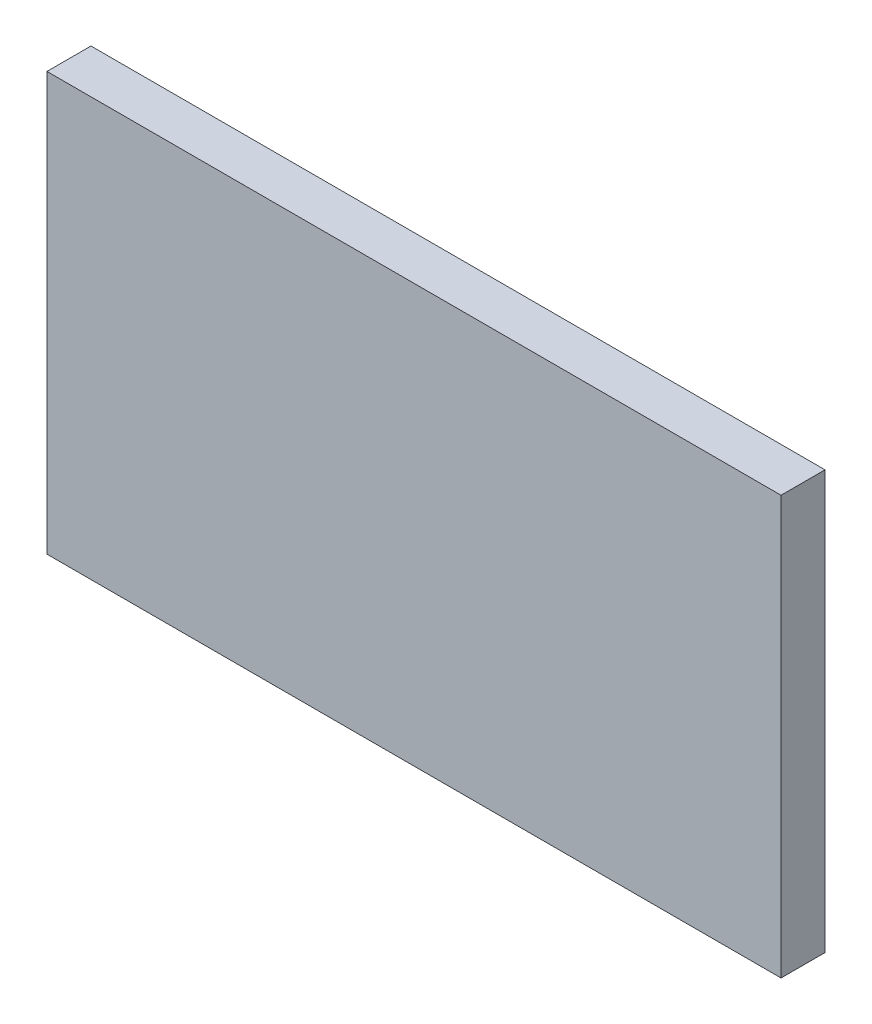
ISO-10303-21;
HEADER;
FILE_DESCRIPTION(('STEP AP214'),'2;1');
FILE_NAME('part.step','',(''),(''),'','','');
FILE_SCHEMA(('AUTOMOTIVE_DESIGN { 1 0 10303 214 1 1 1 1 }'));
ENDSEC;
DATA;
#1=APPLICATION_CONTEXT('core data for automotive mechanical design processes');
#2=APPLICATION_PROTOCOL_DEFINITION('international standard','automotive_design',2000,#1);
#3=PRODUCT_CONTEXT('',#1,'mechanical');
#4=PRODUCT('Part','Part','',(#3));
#5=PRODUCT_RELATED_PRODUCT_CATEGORY('part','',(#4));
#6=PRODUCT_DEFINITION_FORMATION('','',#4);
#7=PRODUCT_DEFINITION_CONTEXT('part definition',#1,'design');
#8=PRODUCT_DEFINITION('design','',#6,#7);
#9=PRODUCT_DEFINITION_SHAPE('','',#8);
#10=(LENGTH_UNIT() NAMED_UNIT(*) SI_UNIT(.MILLI.,.METRE.));
#11=(NAMED_UNIT(*) PLANE_ANGLE_UNIT() SI_UNIT($,.RADIAN.));
#12=(NAMED_UNIT(*) SI_UNIT($,.STERADIAN.) SOLID_ANGLE_UNIT());
#13=UNCERTAINTY_MEASURE_WITH_UNIT(LENGTH_MEASURE(1.E-05),#10,'distance_accuracy_value','');
#14=(GEOMETRIC_REPRESENTATION_CONTEXT(3) GLOBAL_UNCERTAINTY_ASSIGNED_CONTEXT((#13)) GLOBAL_UNIT_ASSIGNED_CONTEXT((#10,
#11,#12)) REPRESENTATION_CONTEXT('',''));
#15=CARTESIAN_POINT('',(0.,0.,0.));
#16=DIRECTION('',(0.,0.,1.));
#17=DIRECTION('',(1.,0.,0.));
#18=AXIS2_PLACEMENT_3D('',#15,#16,#17);
#19=CARTESIAN_POINT('',(-0.838,-0.47,0.1));
#20=DIRECTION('',(0.,0.,-1.));
#21=DIRECTION('',(-1.,0.,0.));
#22=AXIS2_PLACEMENT_3D('',#19,#20,#21);
#23=PLANE('',#22);
#24=DIRECTION('',(0.,1.,0.));
#25=VECTOR('',#24,1.);
#26=CARTESIAN_POINT('',(0.83,-0.47,0.1));
#27=LINE('',#26,#25);
#28=CARTESIAN_POINT('',(0.83,-0.47,0.1));
#29=VERTEX_POINT('',#28);
#30=CARTESIAN_POINT('',(0.83,0.48,0.1));
#31=VERTEX_POINT('',#30);
#32=EDGE_CURVE('E55',#29,#31,#27,.T.);
#33=ORIENTED_EDGE('',*,*,#32,.T.);
#34=DIRECTION('',(1.,0.,0.));
#35=VECTOR('',#34,1.);
#36=CARTESIAN_POINT('',(0.83,0.48,0.1));
#37=LINE('',#36,#35);
#38=CARTESIAN_POINT('',(-0.838,0.48,0.1));
#39=VERTEX_POINT('',#38);
#40=EDGE_CURVE('E57',#31,#39,#37,.F.);
#41=ORIENTED_EDGE('',*,*,#40,.T.);
#42=DIRECTION('',(0.,1.,0.));
#43=VECTOR('',#42,1.);
#44=CARTESIAN_POINT('',(-0.838,0.48,0.1));
#45=LINE('',#44,#43);
#46=CARTESIAN_POINT('',(-0.838,-0.47,0.1));
#47=VERTEX_POINT('',#46);
#48=EDGE_CURVE('E20',#39,#47,#45,.F.);
#49=ORIENTED_EDGE('',*,*,#48,.T.);
#50=DIRECTION('',(1.,0.,0.));
#51=VECTOR('',#50,1.);
#52=CARTESIAN_POINT('',(-0.838,-0.47,0.1));
#53=LINE('',#52,#51);
#54=EDGE_CURVE('E80',#47,#29,#53,.T.);
#55=ORIENTED_EDGE('',*,*,#54,.T.);
#56=EDGE_LOOP('',(#33,#41,#49,#55));
#57=FACE_BOUND('',#56,.T.);
#58=ADVANCED_FACE('F17',(#57),#23,.F.);
#59=CARTESIAN_POINT('',(-0.838,0.48,0.));
#60=DIRECTION('',(1.,0.,0.));
#61=DIRECTION('',(0.,0.,-1.));
#62=AXIS2_PLACEMENT_3D('',#59,#60,#61);
#63=PLANE('',#62);
#64=DIRECTION('',(0.,0.,1.));
#65=VECTOR('',#64,1.);
#66=CARTESIAN_POINT('',(-0.838,-0.47,0.));
#67=LINE('',#66,#65);
#68=CARTESIAN_POINT('',(-0.838,-0.47,0.));
#69=VERTEX_POINT('',#68);
#70=EDGE_CURVE('E68',#69,#47,#67,.T.);
#71=ORIENTED_EDGE('',*,*,#70,.T.);
#72=ORIENTED_EDGE('',*,*,#48,.F.);
#73=DIRECTION('',(0.,0.,-1.));
#74=VECTOR('',#73,1.);
#75=CARTESIAN_POINT('',(-0.838,0.48,0.));
#76=LINE('',#75,#74);
#77=CARTESIAN_POINT('',(-0.838,0.48,0.));
#78=VERTEX_POINT('',#77);
#79=EDGE_CURVE('E63',#39,#78,#76,.T.);
#80=ORIENTED_EDGE('',*,*,#79,.T.);
#81=DIRECTION('',(0.,1.,0.));
#82=VECTOR('',#81,1.);
#83=CARTESIAN_POINT('',(-0.838,-0.47,0.));
#84=LINE('',#83,#82);
#85=EDGE_CURVE('E83',#69,#78,#84,.T.);
#86=ORIENTED_EDGE('',*,*,#85,.F.);
#87=EDGE_LOOP('',(#71,#72,#80,#86));
#88=FACE_BOUND('',#87,.T.);
#89=ADVANCED_FACE('F65',(#88),#63,.F.);
#90=CARTESIAN_POINT('',(0.83,0.48,0.));
#91=DIRECTION('',(0.,-1.,0.));
#92=DIRECTION('',(0.,0.,-1.));
#93=AXIS2_PLACEMENT_3D('',#90,#91,#92);
#94=PLANE('',#93);
#95=ORIENTED_EDGE('',*,*,#79,.F.);
#96=ORIENTED_EDGE('',*,*,#40,.F.);
#97=DIRECTION('',(0.,0.,1.));
#98=VECTOR('',#97,1.);
#99=CARTESIAN_POINT('',(0.83,0.48,0.));
#100=LINE('',#99,#98);
#101=CARTESIAN_POINT('',(0.83,0.48,0.));
#102=VERTEX_POINT('',#101);
#103=EDGE_CURVE('E75',#31,#102,#100,.F.);
#104=ORIENTED_EDGE('',*,*,#103,.T.);
#105=DIRECTION('',(-1.,0.,0.));
#106=VECTOR('',#105,1.);
#107=CARTESIAN_POINT('',(-0.838,0.48,0.));
#108=LINE('',#107,#106);
#109=EDGE_CURVE('E72',#78,#102,#108,.F.);
#110=ORIENTED_EDGE('',*,*,#109,.F.);
#111=EDGE_LOOP('',(#95,#96,#104,#110));
#112=FACE_BOUND('',#111,.T.);
#113=ADVANCED_FACE('F70',(#112),#94,.F.);
#114=CARTESIAN_POINT('',(0.83,-0.47,0.));
#115=DIRECTION('',(-1.,0.,0.));
#116=DIRECTION('',(0.,0.,1.));
#117=AXIS2_PLACEMENT_3D('',#114,#115,#116);
#118=PLANE('',#117);
#119=ORIENTED_EDGE('',*,*,#103,.F.);
#120=ORIENTED_EDGE('',*,*,#32,.F.);
#121=DIRECTION('',(0.,0.,1.));
#122=VECTOR('',#121,1.);
#123=CARTESIAN_POINT('',(0.83,-0.47,0.));
#124=LINE('',#123,#122);
#125=CARTESIAN_POINT('',(0.83,-0.47,0.));
#126=VERTEX_POINT('',#125);
#127=EDGE_CURVE('E35',#29,#126,#124,.F.);
#128=ORIENTED_EDGE('',*,*,#127,.T.);
#129=DIRECTION('',(0.,1.,0.));
#130=VECTOR('',#129,1.);
#131=CARTESIAN_POINT('',(0.83,-0.47,0.));
#132=LINE('',#131,#130);
#133=EDGE_CURVE('E26',#102,#126,#132,.F.);
#134=ORIENTED_EDGE('',*,*,#133,.F.);
#135=EDGE_LOOP('',(#119,#120,#128,#134));
#136=FACE_BOUND('',#135,.T.);
#137=ADVANCED_FACE('F89',(#136),#118,.F.);
#138=CARTESIAN_POINT('',(-0.838,-0.47,0.));
#139=DIRECTION('',(0.,1.,0.));
#140=DIRECTION('',(0.,0.,1.));
#141=AXIS2_PLACEMENT_3D('',#138,#139,#140);
#142=PLANE('',#141);
#143=ORIENTED_EDGE('',*,*,#127,.F.);
#144=ORIENTED_EDGE('',*,*,#54,.F.);
#145=ORIENTED_EDGE('',*,*,#70,.F.);
#146=DIRECTION('',(-1.,0.,0.));
#147=VECTOR('',#146,1.);
#148=CARTESIAN_POINT('',(-0.838,-0.47,0.));
#149=LINE('',#148,#147);
#150=EDGE_CURVE('E11',#126,#69,#149,.T.);
#151=ORIENTED_EDGE('',*,*,#150,.F.);
#152=EDGE_LOOP('',(#143,#144,#145,#151));
#153=FACE_BOUND('',#152,.T.);
#154=ADVANCED_FACE('F91',(#153),#142,.F.);
#155=CARTESIAN_POINT('',(-0.838,-0.47,0.));
#156=DIRECTION('',(0.,0.,-1.));
#157=DIRECTION('',(-1.,0.,0.));
#158=AXIS2_PLACEMENT_3D('',#155,#156,#157);
#159=PLANE('',#158);
#160=ORIENTED_EDGE('',*,*,#133,.T.);
#161=ORIENTED_EDGE('',*,*,#150,.T.);
#162=ORIENTED_EDGE('',*,*,#85,.T.);
#163=ORIENTED_EDGE('',*,*,#109,.T.);
#164=EDGE_LOOP('',(#160,#161,#162,#163));
#165=FACE_BOUND('',#164,.T.);
#166=ADVANCED_FACE('F88',(#165),#159,.T.);
#167=CLOSED_SHELL('',(#58,#89,#113,#137,#154,#166));
#168=MANIFOLD_SOLID_BREP('B1',#167);
#169=ADVANCED_BREP_SHAPE_REPRESENTATION('',(#18,#168),#14);
#170=SHAPE_DEFINITION_REPRESENTATION(#9,#169);
ENDSEC;
END-ISO-10303-21;
